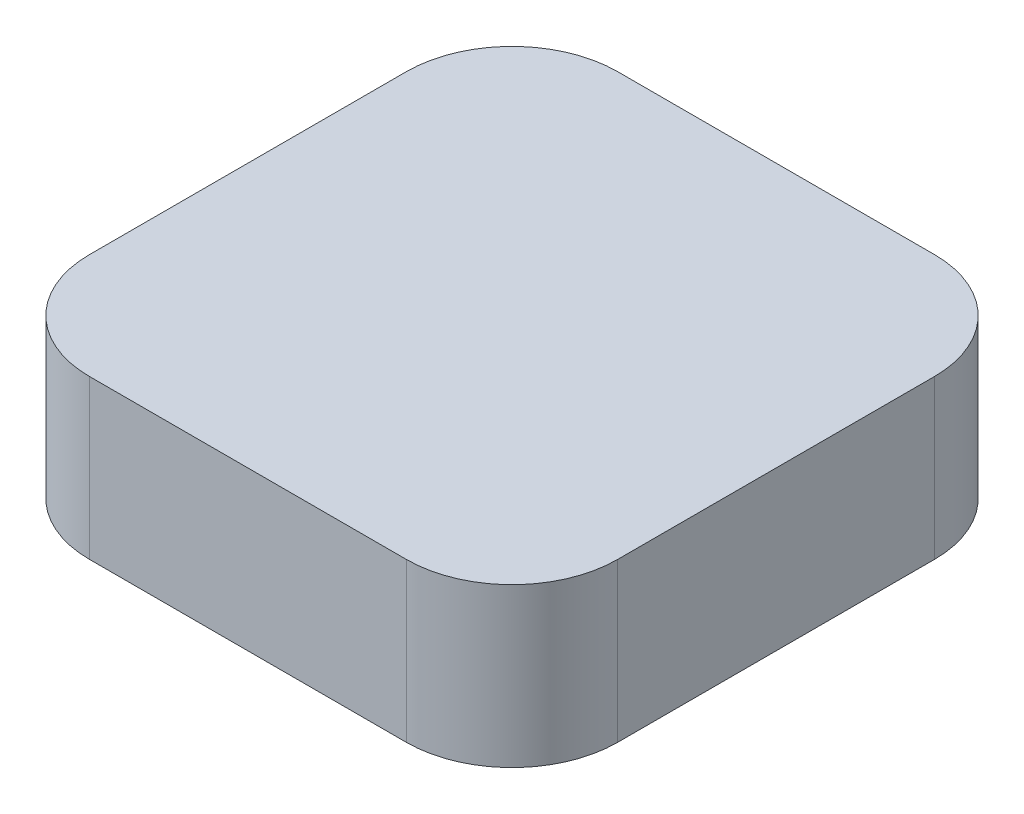
ISO-10303-21;
HEADER;
FILE_DESCRIPTION(('STEP AP214'),'2;1');
FILE_NAME('part.step','',(''),(''),'','','');
FILE_SCHEMA(('AUTOMOTIVE_DESIGN { 1 0 10303 214 1 1 1 1 }'));
ENDSEC;
DATA;
#1=APPLICATION_CONTEXT('core data for automotive mechanical design processes');
#2=APPLICATION_PROTOCOL_DEFINITION('international standard','automotive_design',2000,#1);
#3=PRODUCT_CONTEXT('',#1,'mechanical');
#4=PRODUCT('Part','Part','',(#3));
#5=PRODUCT_RELATED_PRODUCT_CATEGORY('part','',(#4));
#6=PRODUCT_DEFINITION_FORMATION('','',#4);
#7=PRODUCT_DEFINITION_CONTEXT('part definition',#1,'design');
#8=PRODUCT_DEFINITION('design','',#6,#7);
#9=PRODUCT_DEFINITION_SHAPE('','',#8);
#10=(LENGTH_UNIT() NAMED_UNIT(*) SI_UNIT(.MILLI.,.METRE.));
#11=(NAMED_UNIT(*) PLANE_ANGLE_UNIT() SI_UNIT($,.RADIAN.));
#12=(NAMED_UNIT(*) SI_UNIT($,.STERADIAN.) SOLID_ANGLE_UNIT());
#13=UNCERTAINTY_MEASURE_WITH_UNIT(LENGTH_MEASURE(1.E-05),#10,'distance_accuracy_value','');
#14=(GEOMETRIC_REPRESENTATION_CONTEXT(3) GLOBAL_UNCERTAINTY_ASSIGNED_CONTEXT((#13)) GLOBAL_UNIT_ASSIGNED_CONTEXT((#10,
#11,#12)) REPRESENTATION_CONTEXT('',''));
#15=CARTESIAN_POINT('',(0.,0.,0.));
#16=DIRECTION('',(0.,0.,1.));
#17=DIRECTION('',(1.,0.,0.));
#18=AXIS2_PLACEMENT_3D('',#15,#16,#17);
#19=CARTESIAN_POINT('',(-2.53846153846154,3.,4.42307692307692));
#20=DIRECTION('',(0.,-1.,0.));
#21=DIRECTION('',(0.,0.,-1.));
#22=AXIS2_PLACEMENT_3D('',#19,#20,#21);
#23=CYLINDRICAL_SURFACE('',#22,2.);
#24=CARTESIAN_POINT('',(-2.53846153846154,0.,4.42307692307692));
#25=DIRECTION('',(0.,1.,0.));
#26=DIRECTION('',(0.,0.,-1.));
#27=AXIS2_PLACEMENT_3D('',#24,#25,#26);
#28=CIRCLE('',#27,2.);
#29=CARTESIAN_POINT('',(-4.53846153846154,0.,4.42307692307691));
#30=VERTEX_POINT('',#29);
#31=CARTESIAN_POINT('',(-2.53846153846153,0.,6.42307692307692));
#32=VERTEX_POINT('',#31);
#33=EDGE_CURVE('E129',#30,#32,#28,.T.);
#34=ORIENTED_EDGE('',*,*,#33,.T.);
#35=DIRECTION('',(0.,-1.,0.));
#36=VECTOR('',#35,1.);
#37=CARTESIAN_POINT('',(-2.53846153846153,3.,6.42307692307692));
#38=LINE('',#37,#36);
#39=CARTESIAN_POINT('',(-2.53846153846153,3.,6.42307692307692));
#40=VERTEX_POINT('',#39);
#41=EDGE_CURVE('E11',#40,#32,#38,.T.);
#42=ORIENTED_EDGE('',*,*,#41,.F.);
#43=CARTESIAN_POINT('',(-2.53846153846154,3.,4.42307692307692));
#44=DIRECTION('',(0.,1.,0.));
#45=DIRECTION('',(0.,0.,-1.));
#46=AXIS2_PLACEMENT_3D('',#43,#44,#45);
#47=CIRCLE('',#46,2.);
#48=CARTESIAN_POINT('',(-4.53846153846154,3.,4.42307692307691));
#49=VERTEX_POINT('',#48);
#50=EDGE_CURVE('E143',#49,#40,#47,.T.);
#51=ORIENTED_EDGE('',*,*,#50,.F.);
#52=DIRECTION('',(0.,-1.,0.));
#53=VECTOR('',#52,1.);
#54=CARTESIAN_POINT('',(-4.53846153846154,3.,4.42307692307691));
#55=LINE('',#54,#53);
#56=EDGE_CURVE('E125',#49,#30,#55,.T.);
#57=ORIENTED_EDGE('',*,*,#56,.T.);
#58=EDGE_LOOP('',(#34,#42,#51,#57));
#59=FACE_BOUND('',#58,.T.);
#60=ADVANCED_FACE('F33',(#59),#23,.T.);
#61=CARTESIAN_POINT('',(-2.53846153846153,3.,6.42307692307692));
#62=DIRECTION('',(0.,0.,-1.));
#63=DIRECTION('',(-1.,0.,0.));
#64=AXIS2_PLACEMENT_3D('',#61,#62,#63);
#65=PLANE('',#64);
#66=DIRECTION('',(1.,0.,0.));
#67=VECTOR('',#66,1.);
#68=CARTESIAN_POINT('',(-2.53846153846153,0.,6.42307692307692));
#69=LINE('',#68,#67);
#70=CARTESIAN_POINT('',(3.46153846153845,0.,6.42307692307692));
#71=VERTEX_POINT('',#70);
#72=EDGE_CURVE('E132',#32,#71,#69,.T.);
#73=ORIENTED_EDGE('',*,*,#72,.T.);
#74=DIRECTION('',(0.,-1.,0.));
#75=VECTOR('',#74,1.);
#76=CARTESIAN_POINT('',(3.46153846153845,3.,6.42307692307692));
#77=LINE('',#76,#75);
#78=CARTESIAN_POINT('',(3.46153846153845,3.,6.42307692307692));
#79=VERTEX_POINT('',#78);
#80=EDGE_CURVE('E41',#79,#71,#77,.T.);
#81=ORIENTED_EDGE('',*,*,#80,.F.);
#82=DIRECTION('',(1.,0.,0.));
#83=VECTOR('',#82,1.);
#84=CARTESIAN_POINT('',(-2.53846153846153,3.,6.42307692307692));
#85=LINE('',#84,#83);
#86=EDGE_CURVE('E92',#40,#79,#85,.T.);
#87=ORIENTED_EDGE('',*,*,#86,.F.);
#88=ORIENTED_EDGE('',*,*,#41,.T.);
#89=EDGE_LOOP('',(#73,#81,#87,#88));
#90=FACE_BOUND('',#89,.T.);
#91=ADVANCED_FACE('F178',(#90),#65,.F.);
#92=CARTESIAN_POINT('',(3.46153846153846,3.,4.42307692307692));
#93=DIRECTION('',(0.,-1.,0.));
#94=DIRECTION('',(0.,0.,-1.));
#95=AXIS2_PLACEMENT_3D('',#92,#93,#94);
#96=CYLINDRICAL_SURFACE('',#95,2.);
#97=CARTESIAN_POINT('',(3.46153846153846,0.,4.42307692307692));
#98=DIRECTION('',(0.,1.,0.));
#99=DIRECTION('',(0.,0.,1.));
#100=AXIS2_PLACEMENT_3D('',#97,#98,#99);
#101=CIRCLE('',#100,2.);
#102=CARTESIAN_POINT('',(5.46153846153846,0.,4.42307692307691));
#103=VERTEX_POINT('',#102);
#104=EDGE_CURVE('E134',#71,#103,#101,.T.);
#105=ORIENTED_EDGE('',*,*,#104,.T.);
#106=DIRECTION('',(0.,-1.,0.));
#107=VECTOR('',#106,1.);
#108=CARTESIAN_POINT('',(5.46153846153846,3.,4.42307692307691));
#109=LINE('',#108,#107);
#110=CARTESIAN_POINT('',(5.46153846153846,3.,4.42307692307691));
#111=VERTEX_POINT('',#110);
#112=EDGE_CURVE('E150',#111,#103,#109,.T.);
#113=ORIENTED_EDGE('',*,*,#112,.F.);
#114=CARTESIAN_POINT('',(3.46153846153846,3.,4.42307692307692));
#115=DIRECTION('',(0.,1.,0.));
#116=DIRECTION('',(0.,0.,1.));
#117=AXIS2_PLACEMENT_3D('',#114,#115,#116);
#118=CIRCLE('',#117,2.);
#119=EDGE_CURVE('E158',#79,#111,#118,.T.);
#120=ORIENTED_EDGE('',*,*,#119,.F.);
#121=ORIENTED_EDGE('',*,*,#80,.T.);
#122=EDGE_LOOP('',(#105,#113,#120,#121));
#123=FACE_BOUND('',#122,.T.);
#124=ADVANCED_FACE('F156',(#123),#96,.T.);
#125=CARTESIAN_POINT('',(5.46153846153846,3.,-1.57692307692307));
#126=DIRECTION('',(-1.,0.,0.));
#127=DIRECTION('',(0.,0.,1.));
#128=AXIS2_PLACEMENT_3D('',#125,#126,#127);
#129=PLANE('',#128);
#130=DIRECTION('',(0.,0.,-1.));
#131=VECTOR('',#130,1.);
#132=CARTESIAN_POINT('',(5.46153846153846,0.,-1.57692307692307));
#133=LINE('',#132,#131);
#134=CARTESIAN_POINT('',(5.46153846153846,0.,-1.57692307692307));
#135=VERTEX_POINT('',#134);
#136=EDGE_CURVE('E136',#103,#135,#133,.T.);
#137=ORIENTED_EDGE('',*,*,#136,.T.);
#138=DIRECTION('',(0.,-1.,0.));
#139=VECTOR('',#138,1.);
#140=CARTESIAN_POINT('',(5.46153846153846,3.,-1.57692307692307));
#141=LINE('',#140,#139);
#142=CARTESIAN_POINT('',(5.46153846153846,3.,-1.57692307692307));
#143=VERTEX_POINT('',#142);
#144=EDGE_CURVE('E147',#143,#135,#141,.T.);
#145=ORIENTED_EDGE('',*,*,#144,.F.);
#146=DIRECTION('',(0.,0.,-1.));
#147=VECTOR('',#146,1.);
#148=CARTESIAN_POINT('',(5.46153846153846,3.,-1.57692307692307));
#149=LINE('',#148,#147);
#150=EDGE_CURVE('E170',#111,#143,#149,.T.);
#151=ORIENTED_EDGE('',*,*,#150,.F.);
#152=ORIENTED_EDGE('',*,*,#112,.T.);
#153=EDGE_LOOP('',(#137,#145,#151,#152));
#154=FACE_BOUND('',#153,.T.);
#155=ADVANCED_FACE('F166',(#154),#129,.F.);
#156=CARTESIAN_POINT('',(3.46153846153846,3.,-1.57692307692308));
#157=DIRECTION('',(0.,-1.,0.));
#158=DIRECTION('',(0.,0.,-1.));
#159=AXIS2_PLACEMENT_3D('',#156,#157,#158);
#160=CYLINDRICAL_SURFACE('',#159,2.);
#161=CARTESIAN_POINT('',(3.46153846153846,0.,-1.57692307692308));
#162=DIRECTION('',(0.,1.,0.));
#163=DIRECTION('',(0.,0.,1.));
#164=AXIS2_PLACEMENT_3D('',#161,#162,#163);
#165=CIRCLE('',#164,2.);
#166=CARTESIAN_POINT('',(3.46153846153844,0.,-3.57692307692308));
#167=VERTEX_POINT('',#166);
#168=EDGE_CURVE('E138',#135,#167,#165,.T.);
#169=ORIENTED_EDGE('',*,*,#168,.T.);
#170=DIRECTION('',(0.,-1.,0.));
#171=VECTOR('',#170,1.);
#172=CARTESIAN_POINT('',(3.46153846153844,3.,-3.57692307692308));
#173=LINE('',#172,#171);
#174=CARTESIAN_POINT('',(3.46153846153844,3.,-3.57692307692308));
#175=VERTEX_POINT('',#174);
#176=EDGE_CURVE('E120',#175,#167,#173,.T.);
#177=ORIENTED_EDGE('',*,*,#176,.F.);
#178=CARTESIAN_POINT('',(3.46153846153846,3.,-1.57692307692308));
#179=DIRECTION('',(0.,1.,0.));
#180=DIRECTION('',(0.,0.,1.));
#181=AXIS2_PLACEMENT_3D('',#178,#179,#180);
#182=CIRCLE('',#181,2.);
#183=EDGE_CURVE('E111',#143,#175,#182,.T.);
#184=ORIENTED_EDGE('',*,*,#183,.F.);
#185=ORIENTED_EDGE('',*,*,#144,.T.);
#186=EDGE_LOOP('',(#169,#177,#184,#185));
#187=FACE_BOUND('',#186,.T.);
#188=ADVANCED_FACE('F169',(#187),#160,.T.);
#189=CARTESIAN_POINT('',(-2.53846153846153,3.,-3.57692307692308));
#190=DIRECTION('',(0.,0.,1.));
#191=DIRECTION('',(1.,0.,0.));
#192=AXIS2_PLACEMENT_3D('',#189,#190,#191);
#193=PLANE('',#192);
#194=DIRECTION('',(-1.,0.,0.));
#195=VECTOR('',#194,1.);
#196=CARTESIAN_POINT('',(-2.53846153846153,0.,-3.57692307692308));
#197=LINE('',#196,#195);
#198=CARTESIAN_POINT('',(-2.53846153846153,0.,-3.57692307692308));
#199=VERTEX_POINT('',#198);
#200=EDGE_CURVE('E119',#167,#199,#197,.T.);
#201=ORIENTED_EDGE('',*,*,#200,.T.);
#202=DIRECTION('',(0.,-1.,0.));
#203=VECTOR('',#202,1.);
#204=CARTESIAN_POINT('',(-2.53846153846153,3.,-3.57692307692308));
#205=LINE('',#204,#203);
#206=CARTESIAN_POINT('',(-2.53846153846153,3.,-3.57692307692308));
#207=VERTEX_POINT('',#206);
#208=EDGE_CURVE('E116',#207,#199,#205,.T.);
#209=ORIENTED_EDGE('',*,*,#208,.F.);
#210=DIRECTION('',(-1.,0.,0.));
#211=VECTOR('',#210,1.);
#212=CARTESIAN_POINT('',(-2.53846153846153,3.,-3.57692307692308));
#213=LINE('',#212,#211);
#214=EDGE_CURVE('E105',#175,#207,#213,.T.);
#215=ORIENTED_EDGE('',*,*,#214,.F.);
#216=ORIENTED_EDGE('',*,*,#176,.T.);
#217=EDGE_LOOP('',(#201,#209,#215,#216));
#218=FACE_BOUND('',#217,.T.);
#219=ADVANCED_FACE('F117',(#218),#193,.F.);
#220=CARTESIAN_POINT('',(-2.53846153846154,3.,-1.57692307692308));
#221=DIRECTION('',(0.,-1.,0.));
#222=DIRECTION('',(0.,0.,-1.));
#223=AXIS2_PLACEMENT_3D('',#220,#221,#222);
#224=CYLINDRICAL_SURFACE('',#223,2.);
#225=CARTESIAN_POINT('',(-2.53846153846154,0.,-1.57692307692308));
#226=DIRECTION('',(0.,1.,0.));
#227=DIRECTION('',(0.,0.,1.));
#228=AXIS2_PLACEMENT_3D('',#225,#226,#227);
#229=CIRCLE('',#228,2.);
#230=CARTESIAN_POINT('',(-4.53846153846154,0.,-1.57692307692307));
#231=VERTEX_POINT('',#230);
#232=EDGE_CURVE('E78',#199,#231,#229,.T.);
#233=ORIENTED_EDGE('',*,*,#232,.T.);
#234=DIRECTION('',(0.,-1.,0.));
#235=VECTOR('',#234,1.);
#236=CARTESIAN_POINT('',(-4.53846153846154,3.,-1.57692307692307));
#237=LINE('',#236,#235);
#238=CARTESIAN_POINT('',(-4.53846153846154,3.,-1.57692307692307));
#239=VERTEX_POINT('',#238);
#240=EDGE_CURVE('E121',#239,#231,#237,.T.);
#241=ORIENTED_EDGE('',*,*,#240,.F.);
#242=CARTESIAN_POINT('',(-2.53846153846154,3.,-1.57692307692308));
#243=DIRECTION('',(0.,1.,0.));
#244=DIRECTION('',(0.,0.,1.));
#245=AXIS2_PLACEMENT_3D('',#242,#243,#244);
#246=CIRCLE('',#245,2.);
#247=EDGE_CURVE('E109',#207,#239,#246,.T.);
#248=ORIENTED_EDGE('',*,*,#247,.F.);
#249=ORIENTED_EDGE('',*,*,#208,.T.);
#250=EDGE_LOOP('',(#233,#241,#248,#249));
#251=FACE_BOUND('',#250,.T.);
#252=ADVANCED_FACE('F123',(#251),#224,.T.);
#253=CARTESIAN_POINT('',(-4.53846153846154,3.,-1.57692307692307));
#254=DIRECTION('',(1.,0.,0.));
#255=DIRECTION('',(0.,0.,-1.));
#256=AXIS2_PLACEMENT_3D('',#253,#254,#255);
#257=PLANE('',#256);
#258=DIRECTION('',(0.,0.,1.));
#259=VECTOR('',#258,1.);
#260=CARTESIAN_POINT('',(-4.53846153846154,0.,-1.57692307692307));
#261=LINE('',#260,#259);
#262=EDGE_CURVE('E84',#231,#30,#261,.T.);
#263=ORIENTED_EDGE('',*,*,#262,.T.);
#264=ORIENTED_EDGE('',*,*,#56,.F.);
#265=DIRECTION('',(0.,0.,1.));
#266=VECTOR('',#265,1.);
#267=CARTESIAN_POINT('',(-4.53846153846154,3.,-1.57692307692307));
#268=LINE('',#267,#266);
#269=EDGE_CURVE('E49',#239,#49,#268,.T.);
#270=ORIENTED_EDGE('',*,*,#269,.F.);
#271=ORIENTED_EDGE('',*,*,#240,.T.);
#272=EDGE_LOOP('',(#263,#264,#270,#271));
#273=FACE_BOUND('',#272,.T.);
#274=ADVANCED_FACE('F194',(#273),#257,.F.);
#275=CARTESIAN_POINT('',(-2.53846153846154,3.,4.42307692307692));
#276=DIRECTION('',(0.,-1.,0.));
#277=DIRECTION('',(0.,0.,-1.));
#278=AXIS2_PLACEMENT_3D('',#275,#276,#277);
#279=PLANE('',#278);
#280=ORIENTED_EDGE('',*,*,#50,.T.);
#281=ORIENTED_EDGE('',*,*,#86,.T.);
#282=ORIENTED_EDGE('',*,*,#119,.T.);
#283=ORIENTED_EDGE('',*,*,#150,.T.);
#284=ORIENTED_EDGE('',*,*,#183,.T.);
#285=ORIENTED_EDGE('',*,*,#214,.T.);
#286=ORIENTED_EDGE('',*,*,#247,.T.);
#287=ORIENTED_EDGE('',*,*,#269,.T.);
#288=EDGE_LOOP('',(#280,#281,#282,#283,#284,#285,#286,#287));
#289=FACE_BOUND('',#288,.T.);
#290=ADVANCED_FACE('F107',(#289),#279,.F.);
#291=CARTESIAN_POINT('',(-2.53846153846154,0.,4.42307692307692));
#292=DIRECTION('',(0.,-1.,0.));
#293=DIRECTION('',(0.,0.,-1.));
#294=AXIS2_PLACEMENT_3D('',#291,#292,#293);
#295=PLANE('',#294);
#296=ORIENTED_EDGE('',*,*,#33,.F.);
#297=ORIENTED_EDGE('',*,*,#262,.F.);
#298=ORIENTED_EDGE('',*,*,#232,.F.);
#299=ORIENTED_EDGE('',*,*,#200,.F.);
#300=ORIENTED_EDGE('',*,*,#168,.F.);
#301=ORIENTED_EDGE('',*,*,#136,.F.);
#302=ORIENTED_EDGE('',*,*,#104,.F.);
#303=ORIENTED_EDGE('',*,*,#72,.F.);
#304=EDGE_LOOP('',(#296,#297,#298,#299,#300,#301,#302,#303));
#305=FACE_BOUND('',#304,.T.);
#306=ADVANCED_FACE('F162',(#305),#295,.T.);
#307=CLOSED_SHELL('',(#60,#91,#124,#155,#188,#219,#252,#274,#290,#306));
#308=MANIFOLD_SOLID_BREP('B2',#307);
#309=ADVANCED_BREP_SHAPE_REPRESENTATION('',(#18,#308),#14);
#310=SHAPE_DEFINITION_REPRESENTATION(#9,#309);
ENDSEC;
END-ISO-10303-21;
